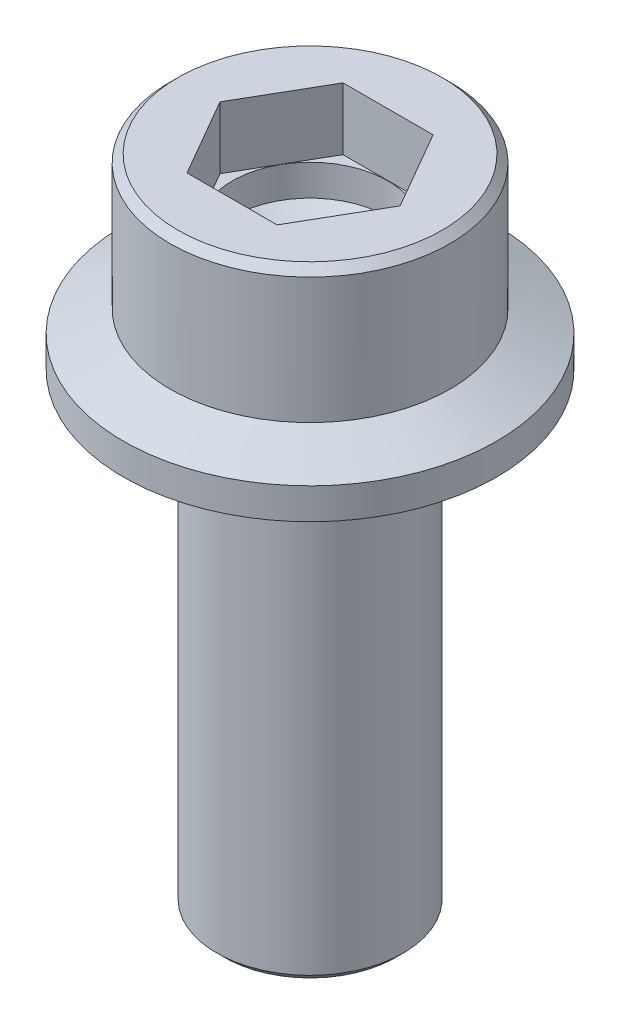
ISO-10303-21;
HEADER;
FILE_DESCRIPTION(('STEP AP214'),'2;1');
FILE_NAME('part.step','',(''),(''),'','','');
FILE_SCHEMA(('AUTOMOTIVE_DESIGN { 1 0 10303 214 1 1 1 1 }'));
ENDSEC;
DATA;
#1=APPLICATION_CONTEXT('core data for automotive mechanical design processes');
#2=APPLICATION_PROTOCOL_DEFINITION('international standard','automotive_design',2000,#1);
#3=PRODUCT_CONTEXT('',#1,'mechanical');
#4=PRODUCT('Part','Part','',(#3));
#5=PRODUCT_RELATED_PRODUCT_CATEGORY('part','',(#4));
#6=PRODUCT_DEFINITION_FORMATION('','',#4);
#7=PRODUCT_DEFINITION_CONTEXT('part definition',#1,'design');
#8=PRODUCT_DEFINITION('design','',#6,#7);
#9=PRODUCT_DEFINITION_SHAPE('','',#8);
#10=(LENGTH_UNIT() NAMED_UNIT(*) SI_UNIT(.MILLI.,.METRE.));
#11=(NAMED_UNIT(*) PLANE_ANGLE_UNIT() SI_UNIT($,.RADIAN.));
#12=(NAMED_UNIT(*) SI_UNIT($,.STERADIAN.) SOLID_ANGLE_UNIT());
#13=UNCERTAINTY_MEASURE_WITH_UNIT(LENGTH_MEASURE(1.E-05),#10,'distance_accuracy_value','');
#14=(GEOMETRIC_REPRESENTATION_CONTEXT(3) GLOBAL_UNCERTAINTY_ASSIGNED_CONTEXT((#13)) GLOBAL_UNIT_ASSIGNED_CONTEXT((#10,
#11,#12)) REPRESENTATION_CONTEXT('',''));
#15=CARTESIAN_POINT('',(0.,0.,0.));
#16=DIRECTION('',(0.,0.,1.));
#17=DIRECTION('',(1.,0.,0.));
#18=AXIS2_PLACEMENT_3D('',#15,#16,#17);
#19=CARTESIAN_POINT('',(0.,0.,0.));
#20=DIRECTION('',(0.,-1.,0.));
#21=DIRECTION('',(0.,0.,-1.));
#22=AXIS2_PLACEMENT_3D('',#19,#20,#21);
#23=PLANE('',#22);
#24=CARTESIAN_POINT('',(0.,0.,0.));
#25=DIRECTION('',(0.,-1.,0.));
#26=DIRECTION('',(0.,0.,-1.));
#27=AXIS2_PLACEMENT_3D('',#24,#25,#26);
#28=CIRCLE('',#27,5.5);
#29=CARTESIAN_POINT('',(0.,0.,-5.5));
#30=VERTEX_POINT('',#29);
#31=EDGE_CURVE('E44',#30,#30,#28,.T.);
#32=ORIENTED_EDGE('',*,*,#31,.T.);
#33=EDGE_LOOP('',(#32));
#34=FACE_BOUND('',#33,.T.);
#35=ADVANCED_FACE('F36',(#34),#23,.T.);
#36=CARTESIAN_POINT('',(0.,0.,0.));
#37=DIRECTION('',(0.,-1.,0.));
#38=DIRECTION('',(0.,0.,-1.));
#39=AXIS2_PLACEMENT_3D('',#36,#37,#38);
#40=CYLINDRICAL_SURFACE('',#39,6.);
#41=CARTESIAN_POINT('',(0.,0.500000000000003,0.));
#42=DIRECTION('',(0.,-1.,0.));
#43=DIRECTION('',(0.,0.,-1.));
#44=AXIS2_PLACEMENT_3D('',#41,#42,#43);
#45=CIRCLE('',#44,6.);
#46=CARTESIAN_POINT('',(0.,0.500000000000003,-6.));
#47=VERTEX_POINT('',#46);
#48=EDGE_CURVE('E11',#47,#47,#45,.F.);
#49=ORIENTED_EDGE('',*,*,#48,.T.);
#50=EDGE_LOOP('',(#49));
#51=FACE_BOUND('',#50,.T.);
#52=CARTESIAN_POINT('',(0.,29.6,0.));
#53=DIRECTION('',(0.,-1.,0.));
#54=DIRECTION('',(0.,0.,-1.));
#55=AXIS2_PLACEMENT_3D('',#52,#53,#54);
#56=CIRCLE('',#55,6.);
#57=CARTESIAN_POINT('',(0.,29.6,-6.));
#58=VERTEX_POINT('',#57);
#59=EDGE_CURVE('E159',#58,#58,#56,.T.);
#60=ORIENTED_EDGE('',*,*,#59,.T.);
#61=EDGE_LOOP('',(#60));
#62=FACE_BOUND('',#61,.T.);
#63=ADVANCED_FACE('F183',(#51,#62),#40,.T.);
#64=CARTESIAN_POINT('',(0.,29.6,0.));
#65=DIRECTION('',(0.,-1.,0.));
#66=DIRECTION('',(0.,0.,-1.));
#67=AXIS2_PLACEMENT_3D('',#64,#65,#66);
#68=TOROIDAL_SURFACE('',#67,6.4,0.400000000000001);
#69=CARTESIAN_POINT('',(0.,30.,0.));
#70=DIRECTION('',(0.,-1.,0.));
#71=DIRECTION('',(0.,0.,-1.));
#72=AXIS2_PLACEMENT_3D('',#69,#70,#71);
#73=CIRCLE('',#72,6.4);
#74=CARTESIAN_POINT('',(0.,30.,-6.4));
#75=VERTEX_POINT('',#74);
#76=EDGE_CURVE('E156',#75,#75,#73,.T.);
#77=ORIENTED_EDGE('',*,*,#76,.T.);
#78=EDGE_LOOP('',(#77));
#79=FACE_BOUND('',#78,.T.);
#80=ORIENTED_EDGE('',*,*,#59,.F.);
#81=EDGE_LOOP('',(#80));
#82=FACE_BOUND('',#81,.T.);
#83=ADVANCED_FACE('F188',(#79,#82),#68,.F.);
#84=CARTESIAN_POINT('',(6.4,30.,0.));
#85=DIRECTION('',(0.,-1.,0.));
#86=DIRECTION('',(0.,0.,-1.));
#87=AXIS2_PLACEMENT_3D('',#84,#85,#86);
#88=PLANE('',#87);
#89=CARTESIAN_POINT('',(0.,30.,0.));
#90=DIRECTION('',(0.,-1.,0.));
#91=DIRECTION('',(0.,0.,-1.));
#92=AXIS2_PLACEMENT_3D('',#89,#90,#91);
#93=CIRCLE('',#92,12.);
#94=CARTESIAN_POINT('',(0.,30.,-12.));
#95=VERTEX_POINT('',#94);
#96=EDGE_CURVE('E153',#95,#95,#93,.T.);
#97=ORIENTED_EDGE('',*,*,#96,.T.);
#98=EDGE_LOOP('',(#97));
#99=FACE_BOUND('',#98,.T.);
#100=ORIENTED_EDGE('',*,*,#76,.F.);
#101=EDGE_LOOP('',(#100));
#102=FACE_BOUND('',#101,.T.);
#103=ADVANCED_FACE('F194',(#99,#102),#88,.T.);
#104=CARTESIAN_POINT('',(0.,0.,0.));
#105=DIRECTION('',(0.,-1.,0.));
#106=DIRECTION('',(0.,0.,-1.));
#107=AXIS2_PLACEMENT_3D('',#104,#105,#106);
#108=CYLINDRICAL_SURFACE('',#107,12.);
#109=CARTESIAN_POINT('',(0.,32.,0.));
#110=DIRECTION('',(0.,-1.,0.));
#111=DIRECTION('',(0.,0.,-1.));
#112=AXIS2_PLACEMENT_3D('',#109,#110,#111);
#113=CIRCLE('',#112,12.);
#114=CARTESIAN_POINT('',(0.,32.,-12.));
#115=VERTEX_POINT('',#114);
#116=EDGE_CURVE('E150',#115,#115,#113,.T.);
#117=ORIENTED_EDGE('',*,*,#116,.T.);
#118=EDGE_LOOP('',(#117));
#119=FACE_BOUND('',#118,.T.);
#120=ORIENTED_EDGE('',*,*,#96,.F.);
#121=EDGE_LOOP('',(#120));
#122=FACE_BOUND('',#121,.T.);
#123=ADVANCED_FACE('F198',(#119,#122),#108,.T.);
#124=CARTESIAN_POINT('',(0.,32.,0.));
#125=DIRECTION('',(0.,-1.,0.));
#126=DIRECTION('',(0.,0.,-1.));
#127=AXIS2_PLACEMENT_3D('',#124,#125,#126);
#128=CONICAL_SURFACE('',#127,12.,1.13446401379632);
#129=CARTESIAN_POINT('',(0.,33.398922974465,0.));
#130=DIRECTION('',(0.,-1.,0.));
#131=DIRECTION('',(0.,0.,-1.));
#132=AXIS2_PLACEMENT_3D('',#129,#130,#131);
#133=CIRCLE('',#132,9.);
#134=CARTESIAN_POINT('',(0.,33.398922974465,-9.));
#135=VERTEX_POINT('',#134);
#136=EDGE_CURVE('E147',#135,#135,#133,.T.);
#137=ORIENTED_EDGE('',*,*,#136,.T.);
#138=EDGE_LOOP('',(#137));
#139=FACE_BOUND('',#138,.T.);
#140=ORIENTED_EDGE('',*,*,#116,.F.);
#141=EDGE_LOOP('',(#140));
#142=FACE_BOUND('',#141,.T.);
#143=ADVANCED_FACE('F202',(#139,#142),#128,.T.);
#144=CARTESIAN_POINT('',(0.,0.,0.));
#145=DIRECTION('',(0.,-1.,0.));
#146=DIRECTION('',(0.,0.,-1.));
#147=AXIS2_PLACEMENT_3D('',#144,#145,#146);
#148=CYLINDRICAL_SURFACE('',#147,9.);
#149=CARTESIAN_POINT('',(0.,41.5,0.));
#150=DIRECTION('',(0.,1.,0.));
#151=DIRECTION('',(0.,0.,1.));
#152=AXIS2_PLACEMENT_3D('',#149,#150,#151);
#153=CIRCLE('',#152,9.);
#154=CARTESIAN_POINT('',(0.,41.5,9.));
#155=VERTEX_POINT('',#154);
#156=EDGE_CURVE('E162',#155,#155,#153,.F.);
#157=ORIENTED_EDGE('',*,*,#156,.T.);
#158=EDGE_LOOP('',(#157));
#159=FACE_BOUND('',#158,.T.);
#160=ORIENTED_EDGE('',*,*,#136,.F.);
#161=EDGE_LOOP('',(#160));
#162=FACE_BOUND('',#161,.T.);
#163=ADVANCED_FACE('F206',(#159,#162),#148,.T.);
#164=CARTESIAN_POINT('',(5.,42.,0.));
#165=DIRECTION('',(0.,1.,0.));
#166=DIRECTION('',(0.,0.,1.));
#167=AXIS2_PLACEMENT_3D('',#164,#165,#166);
#168=PLANE('',#167);
#169=CARTESIAN_POINT('',(0.,42.,0.));
#170=DIRECTION('',(0.,1.,0.));
#171=DIRECTION('',(0.,0.,1.));
#172=AXIS2_PLACEMENT_3D('',#169,#170,#171);
#173=CIRCLE('',#172,8.50000000000001);
#174=CARTESIAN_POINT('',(0.,42.,8.50000000000001));
#175=VERTEX_POINT('',#174);
#176=EDGE_CURVE('E167',#175,#175,#173,.T.);
#177=ORIENTED_EDGE('',*,*,#176,.T.);
#178=EDGE_LOOP('',(#177));
#179=FACE_BOUND('',#178,.T.);
#180=DIRECTION('',(-0.5,0.,0.866025403784438));
#181=VECTOR('',#180,1.);
#182=CARTESIAN_POINT('',(-2.89541159998597,42.,-5.015));
#183=LINE('',#182,#181);
#184=CARTESIAN_POINT('',(-2.89541159998597,42.,-5.015));
#185=VERTEX_POINT('',#184);
#186=CARTESIAN_POINT('',(-5.79082319997195,42.,0.));
#187=VERTEX_POINT('',#186);
#188=EDGE_CURVE('E51',#185,#187,#183,.T.);
#189=ORIENTED_EDGE('',*,*,#188,.F.);
#190=DIRECTION('',(-1.,0.,0.));
#191=VECTOR('',#190,1.);
#192=CARTESIAN_POINT('',(2.89541159998598,42.,-5.015));
#193=LINE('',#192,#191);
#194=CARTESIAN_POINT('',(2.89541159998598,42.,-5.015));
#195=VERTEX_POINT('',#194);
#196=EDGE_CURVE('E110',#195,#185,#193,.T.);
#197=ORIENTED_EDGE('',*,*,#196,.F.);
#198=DIRECTION('',(-0.5,0.,-0.866025403784439));
#199=VECTOR('',#198,1.);
#200=CARTESIAN_POINT('',(5.79082319997195,42.,0.));
#201=LINE('',#200,#199);
#202=CARTESIAN_POINT('',(5.79082319997195,42.,0.));
#203=VERTEX_POINT('',#202);
#204=EDGE_CURVE('E113',#203,#195,#201,.T.);
#205=ORIENTED_EDGE('',*,*,#204,.F.);
#206=DIRECTION('',(0.5,0.,-0.866025403784439));
#207=VECTOR('',#206,1.);
#208=CARTESIAN_POINT('',(2.89541159998597,42.,5.015));
#209=LINE('',#208,#207);
#210=CARTESIAN_POINT('',(2.89541159998597,42.,5.015));
#211=VERTEX_POINT('',#210);
#212=EDGE_CURVE('E129',#211,#203,#209,.T.);
#213=ORIENTED_EDGE('',*,*,#212,.F.);
#214=DIRECTION('',(1.,0.,0.));
#215=VECTOR('',#214,1.);
#216=CARTESIAN_POINT('',(-2.89541159998597,42.,5.015));
#217=LINE('',#216,#215);
#218=CARTESIAN_POINT('',(-2.89541159998597,42.,5.015));
#219=VERTEX_POINT('',#218);
#220=EDGE_CURVE('E126',#219,#211,#217,.T.);
#221=ORIENTED_EDGE('',*,*,#220,.F.);
#222=DIRECTION('',(0.5,0.,0.866025403784439));
#223=VECTOR('',#222,1.);
#224=CARTESIAN_POINT('',(-5.79082319997195,42.,0.));
#225=LINE('',#224,#223);
#226=EDGE_CURVE('E124',#187,#219,#225,.T.);
#227=ORIENTED_EDGE('',*,*,#226,.F.);
#228=EDGE_LOOP('',(#189,#197,#205,#213,#221,#227));
#229=FACE_BOUND('',#228,.T.);
#230=ADVANCED_FACE('F210',(#179,#229),#168,.T.);
#231=CARTESIAN_POINT('',(-2.89541159998597,38.,-5.015));
#232=DIRECTION('',(-0.866025403784439,0.,-0.5));
#233=DIRECTION('',(-0.5,0.,0.866025403784438));
#234=AXIS2_PLACEMENT_3D('',#231,#232,#233);
#235=PLANE('',#234);
#236=ORIENTED_EDGE('',*,*,#188,.T.);
#237=DIRECTION('',(0.,1.,0.));
#238=VECTOR('',#237,1.);
#239=CARTESIAN_POINT('',(-5.79082319997195,38.,0.));
#240=LINE('',#239,#238);
#241=CARTESIAN_POINT('',(-5.79082319997195,38.,0.));
#242=VERTEX_POINT('',#241);
#243=EDGE_CURVE('E87',#242,#187,#240,.T.);
#244=ORIENTED_EDGE('',*,*,#243,.F.);
#245=DIRECTION('',(-0.5,0.,0.866025403784438));
#246=VECTOR('',#245,1.);
#247=CARTESIAN_POINT('',(-2.89541159998597,38.,-5.015));
#248=LINE('',#247,#246);
#249=CARTESIAN_POINT('',(-2.89541159998597,38.,-5.015));
#250=VERTEX_POINT('',#249);
#251=EDGE_CURVE('E91',#250,#242,#248,.T.);
#252=ORIENTED_EDGE('',*,*,#251,.F.);
#253=DIRECTION('',(0.,1.,0.));
#254=VECTOR('',#253,1.);
#255=CARTESIAN_POINT('',(-2.89541159998597,38.,-5.015));
#256=LINE('',#255,#254);
#257=EDGE_CURVE('E134',#250,#185,#256,.T.);
#258=ORIENTED_EDGE('',*,*,#257,.T.);
#259=EDGE_LOOP('',(#236,#244,#252,#258));
#260=FACE_BOUND('',#259,.T.);
#261=ADVANCED_FACE('F89',(#260),#235,.F.);
#262=CARTESIAN_POINT('',(2.89541159998598,38.,-5.015));
#263=DIRECTION('',(0.,0.,-1.));
#264=DIRECTION('',(-1.,0.,0.));
#265=AXIS2_PLACEMENT_3D('',#262,#263,#264);
#266=PLANE('',#265);
#267=ORIENTED_EDGE('',*,*,#196,.T.);
#268=ORIENTED_EDGE('',*,*,#257,.F.);
#269=DIRECTION('',(-1.,0.,0.));
#270=VECTOR('',#269,1.);
#271=CARTESIAN_POINT('',(2.89541159998598,38.,-5.015));
#272=LINE('',#271,#270);
#273=CARTESIAN_POINT('',(2.89541159998598,38.,-5.015));
#274=VERTEX_POINT('',#273);
#275=EDGE_CURVE('E97',#274,#250,#272,.T.);
#276=ORIENTED_EDGE('',*,*,#275,.F.);
#277=DIRECTION('',(0.,1.,0.));
#278=VECTOR('',#277,1.);
#279=CARTESIAN_POINT('',(2.89541159998598,38.,-5.015));
#280=LINE('',#279,#278);
#281=EDGE_CURVE('E137',#274,#195,#280,.T.);
#282=ORIENTED_EDGE('',*,*,#281,.T.);
#283=EDGE_LOOP('',(#267,#268,#276,#282));
#284=FACE_BOUND('',#283,.T.);
#285=ADVANCED_FACE('F223',(#284),#266,.F.);
#286=CARTESIAN_POINT('',(5.79082319997195,38.,0.));
#287=DIRECTION('',(0.866025403784439,0.,-0.5));
#288=DIRECTION('',(-0.5,0.,-0.866025403784439));
#289=AXIS2_PLACEMENT_3D('',#286,#287,#288);
#290=PLANE('',#289);
#291=ORIENTED_EDGE('',*,*,#204,.T.);
#292=ORIENTED_EDGE('',*,*,#281,.F.);
#293=DIRECTION('',(-0.5,0.,-0.866025403784439));
#294=VECTOR('',#293,1.);
#295=CARTESIAN_POINT('',(5.79082319997195,38.,0.));
#296=LINE('',#295,#294);
#297=CARTESIAN_POINT('',(5.79082319997195,38.,0.));
#298=VERTEX_POINT('',#297);
#299=EDGE_CURVE('E120',#298,#274,#296,.T.);
#300=ORIENTED_EDGE('',*,*,#299,.F.);
#301=DIRECTION('',(0.,1.,0.));
#302=VECTOR('',#301,1.);
#303=CARTESIAN_POINT('',(5.79082319997195,38.,0.));
#304=LINE('',#303,#302);
#305=EDGE_CURVE('E139',#298,#203,#304,.T.);
#306=ORIENTED_EDGE('',*,*,#305,.T.);
#307=EDGE_LOOP('',(#291,#292,#300,#306));
#308=FACE_BOUND('',#307,.T.);
#309=ADVANCED_FACE('F233',(#308),#290,.F.);
#310=CARTESIAN_POINT('',(2.89541159998597,38.,5.015));
#311=DIRECTION('',(0.866025403784439,0.,0.5));
#312=DIRECTION('',(0.5,0.,-0.866025403784439));
#313=AXIS2_PLACEMENT_3D('',#310,#311,#312);
#314=PLANE('',#313);
#315=ORIENTED_EDGE('',*,*,#212,.T.);
#316=ORIENTED_EDGE('',*,*,#305,.F.);
#317=DIRECTION('',(0.5,0.,-0.866025403784439));
#318=VECTOR('',#317,1.);
#319=CARTESIAN_POINT('',(2.89541159998597,38.,5.015));
#320=LINE('',#319,#318);
#321=CARTESIAN_POINT('',(2.89541159998597,38.,5.015));
#322=VERTEX_POINT('',#321);
#323=EDGE_CURVE('E117',#322,#298,#320,.T.);
#324=ORIENTED_EDGE('',*,*,#323,.F.);
#325=DIRECTION('',(0.,1.,0.));
#326=VECTOR('',#325,1.);
#327=CARTESIAN_POINT('',(2.89541159998597,38.,5.015));
#328=LINE('',#327,#326);
#329=EDGE_CURVE('E141',#322,#211,#328,.T.);
#330=ORIENTED_EDGE('',*,*,#329,.T.);
#331=EDGE_LOOP('',(#315,#316,#324,#330));
#332=FACE_BOUND('',#331,.T.);
#333=ADVANCED_FACE('F229',(#332),#314,.F.);
#334=CARTESIAN_POINT('',(-2.89541159998597,38.,5.015));
#335=DIRECTION('',(0.,0.,1.));
#336=DIRECTION('',(1.,0.,0.));
#337=AXIS2_PLACEMENT_3D('',#334,#335,#336);
#338=PLANE('',#337);
#339=ORIENTED_EDGE('',*,*,#220,.T.);
#340=ORIENTED_EDGE('',*,*,#329,.F.);
#341=DIRECTION('',(1.,0.,0.));
#342=VECTOR('',#341,1.);
#343=CARTESIAN_POINT('',(-2.89541159998597,38.,5.015));
#344=LINE('',#343,#342);
#345=CARTESIAN_POINT('',(-2.89541159998597,38.,5.015));
#346=VERTEX_POINT('',#345);
#347=EDGE_CURVE('E105',#346,#322,#344,.T.);
#348=ORIENTED_EDGE('',*,*,#347,.F.);
#349=DIRECTION('',(0.,1.,0.));
#350=VECTOR('',#349,1.);
#351=CARTESIAN_POINT('',(-2.89541159998597,38.,5.015));
#352=LINE('',#351,#350);
#353=EDGE_CURVE('E96',#346,#219,#352,.T.);
#354=ORIENTED_EDGE('',*,*,#353,.T.);
#355=EDGE_LOOP('',(#339,#340,#348,#354));
#356=FACE_BOUND('',#355,.T.);
#357=ADVANCED_FACE('F226',(#356),#338,.F.);
#358=CARTESIAN_POINT('',(-5.79082319997195,38.,0.));
#359=DIRECTION('',(-0.866025403784439,0.,0.5));
#360=DIRECTION('',(0.5,0.,0.866025403784439));
#361=AXIS2_PLACEMENT_3D('',#358,#359,#360);
#362=PLANE('',#361);
#363=ORIENTED_EDGE('',*,*,#226,.T.);
#364=ORIENTED_EDGE('',*,*,#353,.F.);
#365=DIRECTION('',(0.5,0.,0.866025403784439));
#366=VECTOR('',#365,1.);
#367=CARTESIAN_POINT('',(-5.79082319997195,38.,0.));
#368=LINE('',#367,#366);
#369=EDGE_CURVE('E100',#242,#346,#368,.T.);
#370=ORIENTED_EDGE('',*,*,#369,.F.);
#371=ORIENTED_EDGE('',*,*,#243,.T.);
#372=EDGE_LOOP('',(#363,#364,#370,#371));
#373=FACE_BOUND('',#372,.T.);
#374=ADVANCED_FACE('F101',(#373),#362,.F.);
#375=CARTESIAN_POINT('',(-5.79082319997195,38.,0.));
#376=DIRECTION('',(0.,1.,0.));
#377=DIRECTION('',(0.,0.,1.));
#378=AXIS2_PLACEMENT_3D('',#375,#376,#377);
#379=PLANE('',#378);
#380=CARTESIAN_POINT('',(0.,38.,0.));
#381=DIRECTION('',(0.,1.,0.));
#382=DIRECTION('',(0.,0.,1.));
#383=AXIS2_PLACEMENT_3D('',#380,#381,#382);
#384=CIRCLE('',#383,5.);
#385=CARTESIAN_POINT('',(0.,38.,5.));
#386=VERTEX_POINT('',#385);
#387=EDGE_CURVE('E136',#386,#386,#384,.T.);
#388=ORIENTED_EDGE('',*,*,#387,.F.);
#389=EDGE_LOOP('',(#388));
#390=FACE_BOUND('',#389,.T.);
#391=ORIENTED_EDGE('',*,*,#251,.T.);
#392=ORIENTED_EDGE('',*,*,#369,.T.);
#393=ORIENTED_EDGE('',*,*,#347,.T.);
#394=ORIENTED_EDGE('',*,*,#323,.T.);
#395=ORIENTED_EDGE('',*,*,#299,.T.);
#396=ORIENTED_EDGE('',*,*,#275,.T.);
#397=EDGE_LOOP('',(#391,#392,#393,#394,#395,#396));
#398=FACE_BOUND('',#397,.T.);
#399=ADVANCED_FACE('F107',(#390,#398),#379,.T.);
#400=CARTESIAN_POINT('',(0.,36.,0.));
#401=DIRECTION('',(0.,1.,0.));
#402=DIRECTION('',(0.,0.,1.));
#403=AXIS2_PLACEMENT_3D('',#400,#401,#402);
#404=CONICAL_SURFACE('',#403,5.,1.02974425867666);
#405=CARTESIAN_POINT('',(0.,32.9956969048622,0.));
#406=VERTEX_POINT('',#405);
#407=VERTEX_LOOP('',#406);
#408=FACE_BOUND('',#407,.T.);
#409=CARTESIAN_POINT('',(0.,36.,0.));
#410=DIRECTION('',(0.,-1.,0.));
#411=DIRECTION('',(0.,0.,-1.));
#412=AXIS2_PLACEMENT_3D('',#409,#410,#411);
#413=CIRCLE('',#412,5.);
#414=CARTESIAN_POINT('',(0.,36.,-5.));
#415=VERTEX_POINT('',#414);
#416=EDGE_CURVE('E144',#415,#415,#413,.T.);
#417=ORIENTED_EDGE('',*,*,#416,.F.);
#418=EDGE_LOOP('',(#417));
#419=FACE_BOUND('',#418,.T.);
#420=ADVANCED_FACE('F217',(#408,#419),#404,.F.);
#421=CARTESIAN_POINT('',(0.,0.,0.));
#422=DIRECTION('',(0.,-1.,0.));
#423=DIRECTION('',(0.,0.,-1.));
#424=AXIS2_PLACEMENT_3D('',#421,#422,#423);
#425=CYLINDRICAL_SURFACE('',#424,5.);
#426=ORIENTED_EDGE('',*,*,#416,.T.);
#427=EDGE_LOOP('',(#426));
#428=FACE_BOUND('',#427,.T.);
#429=ORIENTED_EDGE('',*,*,#387,.T.);
#430=EDGE_LOOP('',(#429));
#431=FACE_BOUND('',#430,.T.);
#432=ADVANCED_FACE('F179',(#428,#431),#425,.F.);
#433=CARTESIAN_POINT('',(0.,41.5,0.));
#434=DIRECTION('',(0.,-1.,0.));
#435=DIRECTION('',(0.,0.,-1.));
#436=AXIS2_PLACEMENT_3D('',#433,#434,#435);
#437=CONICAL_SURFACE('',#436,9.,0.785398163397445);
#438=ORIENTED_EDGE('',*,*,#176,.F.);
#439=EDGE_LOOP('',(#438));
#440=FACE_BOUND('',#439,.T.);
#441=ORIENTED_EDGE('',*,*,#156,.F.);
#442=EDGE_LOOP('',(#441));
#443=FACE_BOUND('',#442,.T.);
#444=ADVANCED_FACE('F174',(#440,#443),#437,.T.);
#445=CARTESIAN_POINT('',(0.,0.,0.));
#446=DIRECTION('',(0.,1.,0.));
#447=DIRECTION('',(0.,0.,1.));
#448=AXIS2_PLACEMENT_3D('',#445,#446,#447);
#449=CONICAL_SURFACE('',#448,5.5,0.785398163397448);
#450=ORIENTED_EDGE('',*,*,#48,.F.);
#451=EDGE_LOOP('',(#450));
#452=FACE_BOUND('',#451,.T.);
#453=ORIENTED_EDGE('',*,*,#31,.F.);
#454=EDGE_LOOP('',(#453));
#455=FACE_BOUND('',#454,.T.);
#456=ADVANCED_FACE('F38',(#452,#455),#449,.T.);
#457=CLOSED_SHELL('',(#35,#63,#83,#103,#123,#143,#163,#230,#261,#285,#309,#333,#357,#374,#399,
#420,#432,#444,#456));
#458=MANIFOLD_SOLID_BREP('B2',#457);
#459=ADVANCED_BREP_SHAPE_REPRESENTATION('',(#18,#458),#14);
#460=SHAPE_DEFINITION_REPRESENTATION(#9,#459);
ENDSEC;
END-ISO-10303-21;
